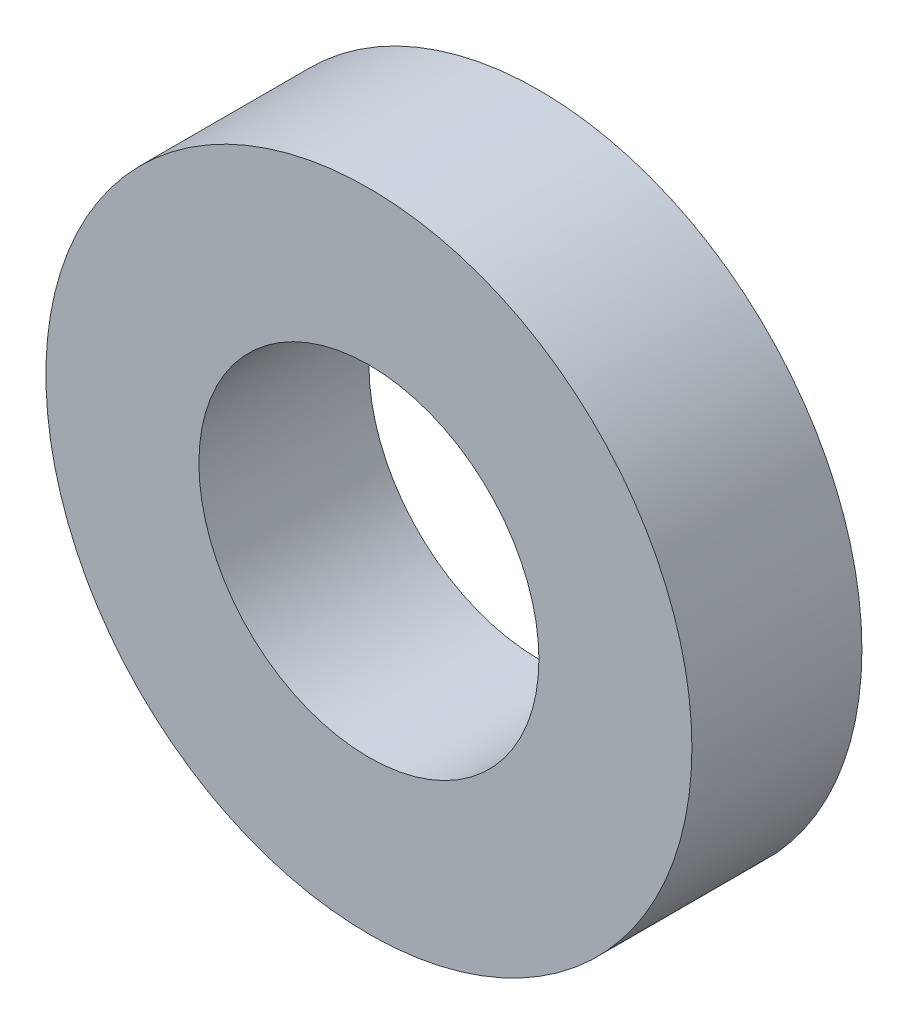
ISO-10303-21;
HEADER;
FILE_DESCRIPTION(('STEP AP214'),'2;1');
FILE_NAME('part.step','',(''),(''),'','','');
FILE_SCHEMA(('AUTOMOTIVE_DESIGN { 1 0 10303 214 1 1 1 1 }'));
ENDSEC;
DATA;
#1=APPLICATION_CONTEXT('core data for automotive mechanical design processes');
#2=APPLICATION_PROTOCOL_DEFINITION('international standard','automotive_design',2000,#1);
#3=PRODUCT_CONTEXT('',#1,'mechanical');
#4=PRODUCT('Part','Part','',(#3));
#5=PRODUCT_RELATED_PRODUCT_CATEGORY('part','',(#4));
#6=PRODUCT_DEFINITION_FORMATION('','',#4);
#7=PRODUCT_DEFINITION_CONTEXT('part definition',#1,'design');
#8=PRODUCT_DEFINITION('design','',#6,#7);
#9=PRODUCT_DEFINITION_SHAPE('','',#8);
#10=(LENGTH_UNIT() NAMED_UNIT(*) SI_UNIT(.MILLI.,.METRE.));
#11=(NAMED_UNIT(*) PLANE_ANGLE_UNIT() SI_UNIT($,.RADIAN.));
#12=(NAMED_UNIT(*) SI_UNIT($,.STERADIAN.) SOLID_ANGLE_UNIT());
#13=UNCERTAINTY_MEASURE_WITH_UNIT(LENGTH_MEASURE(1.E-05),#10,'distance_accuracy_value','');
#14=(GEOMETRIC_REPRESENTATION_CONTEXT(3) GLOBAL_UNCERTAINTY_ASSIGNED_CONTEXT((#13)) GLOBAL_UNIT_ASSIGNED_CONTEXT((#10,
#11,#12)) REPRESENTATION_CONTEXT('',''));
#15=CARTESIAN_POINT('',(0.,0.,0.));
#16=DIRECTION('',(0.,0.,1.));
#17=DIRECTION('',(1.,0.,0.));
#18=AXIS2_PLACEMENT_3D('',#15,#16,#17);
#19=CARTESIAN_POINT('',(0.,0.,5.));
#20=DIRECTION('',(0.,0.,1.));
#21=DIRECTION('',(1.,0.,0.));
#22=AXIS2_PLACEMENT_3D('',#19,#20,#21);
#23=PLANE('',#22);
#24=CARTESIAN_POINT('',(0.,0.,5.));
#25=DIRECTION('',(0.,0.,1.));
#26=DIRECTION('',(1.,0.,0.));
#27=AXIS2_PLACEMENT_3D('',#24,#25,#26);
#28=CIRCLE('',#27,9.5);
#29=CARTESIAN_POINT('',(9.5,0.,5.));
#30=VERTEX_POINT('',#29);
#31=EDGE_CURVE('E10',#30,#30,#28,.T.);
#32=ORIENTED_EDGE('',*,*,#31,.T.);
#33=EDGE_LOOP('',(#32));
#34=FACE_BOUND('',#33,.T.);
#35=CARTESIAN_POINT('',(0.,0.,5.));
#36=DIRECTION('',(0.,0.,1.));
#37=DIRECTION('',(1.,0.,0.));
#38=AXIS2_PLACEMENT_3D('',#35,#36,#37);
#39=CIRCLE('',#38,5.);
#40=CARTESIAN_POINT('',(5.,0.,5.));
#41=VERTEX_POINT('',#40);
#42=EDGE_CURVE('E45',#41,#41,#39,.T.);
#43=ORIENTED_EDGE('',*,*,#42,.F.);
#44=EDGE_LOOP('',(#43));
#45=FACE_BOUND('',#44,.T.);
#46=ADVANCED_FACE('F34',(#34,#45),#23,.T.);
#47=CARTESIAN_POINT('',(0.,0.,0.));
#48=DIRECTION('',(0.,0.,1.));
#49=DIRECTION('',(1.,0.,0.));
#50=AXIS2_PLACEMENT_3D('',#47,#48,#49);
#51=PLANE('',#50);
#52=CARTESIAN_POINT('',(0.,0.,0.));
#53=DIRECTION('',(0.,0.,1.));
#54=DIRECTION('',(1.,0.,0.));
#55=AXIS2_PLACEMENT_3D('',#52,#53,#54);
#56=CIRCLE('',#55,9.5);
#57=CARTESIAN_POINT('',(9.5,0.,0.));
#58=VERTEX_POINT('',#57);
#59=EDGE_CURVE('E38',#58,#58,#56,.T.);
#60=ORIENTED_EDGE('',*,*,#59,.F.);
#61=EDGE_LOOP('',(#60));
#62=FACE_BOUND('',#61,.T.);
#63=CARTESIAN_POINT('',(0.,0.,0.));
#64=DIRECTION('',(0.,0.,1.));
#65=DIRECTION('',(1.,0.,0.));
#66=AXIS2_PLACEMENT_3D('',#63,#64,#65);
#67=CIRCLE('',#66,5.);
#68=CARTESIAN_POINT('',(5.,0.,0.));
#69=VERTEX_POINT('',#68);
#70=EDGE_CURVE('E47',#69,#69,#67,.T.);
#71=ORIENTED_EDGE('',*,*,#70,.T.);
#72=EDGE_LOOP('',(#71));
#73=FACE_BOUND('',#72,.T.);
#74=ADVANCED_FACE('F57',(#62,#73),#51,.F.);
#75=CARTESIAN_POINT('',(0.,0.,5.));
#76=DIRECTION('',(0.,0.,-1.));
#77=DIRECTION('',(-1.,0.,0.));
#78=AXIS2_PLACEMENT_3D('',#75,#76,#77);
#79=CYLINDRICAL_SURFACE('',#78,9.5);
#80=ORIENTED_EDGE('',*,*,#31,.F.);
#81=EDGE_LOOP('',(#80));
#82=FACE_BOUND('',#81,.T.);
#83=ORIENTED_EDGE('',*,*,#59,.T.);
#84=EDGE_LOOP('',(#83));
#85=FACE_BOUND('',#84,.T.);
#86=ADVANCED_FACE('F36',(#82,#85),#79,.T.);
#87=CARTESIAN_POINT('',(0.,0.,5.));
#88=DIRECTION('',(0.,0.,-1.));
#89=DIRECTION('',(-1.,0.,0.));
#90=AXIS2_PLACEMENT_3D('',#87,#88,#89);
#91=CYLINDRICAL_SURFACE('',#90,5.);
#92=ORIENTED_EDGE('',*,*,#42,.T.);
#93=EDGE_LOOP('',(#92));
#94=FACE_BOUND('',#93,.T.);
#95=ORIENTED_EDGE('',*,*,#70,.F.);
#96=EDGE_LOOP('',(#95));
#97=FACE_BOUND('',#96,.T.);
#98=ADVANCED_FACE('F53',(#94,#97),#91,.F.);
#99=CLOSED_SHELL('',(#46,#74,#86,#98));
#100=MANIFOLD_SOLID_BREP('B2',#99);
#101=ADVANCED_BREP_SHAPE_REPRESENTATION('',(#18,#100),#14);
#102=SHAPE_DEFINITION_REPRESENTATION(#9,#101);
ENDSEC;
END-ISO-10303-21;
